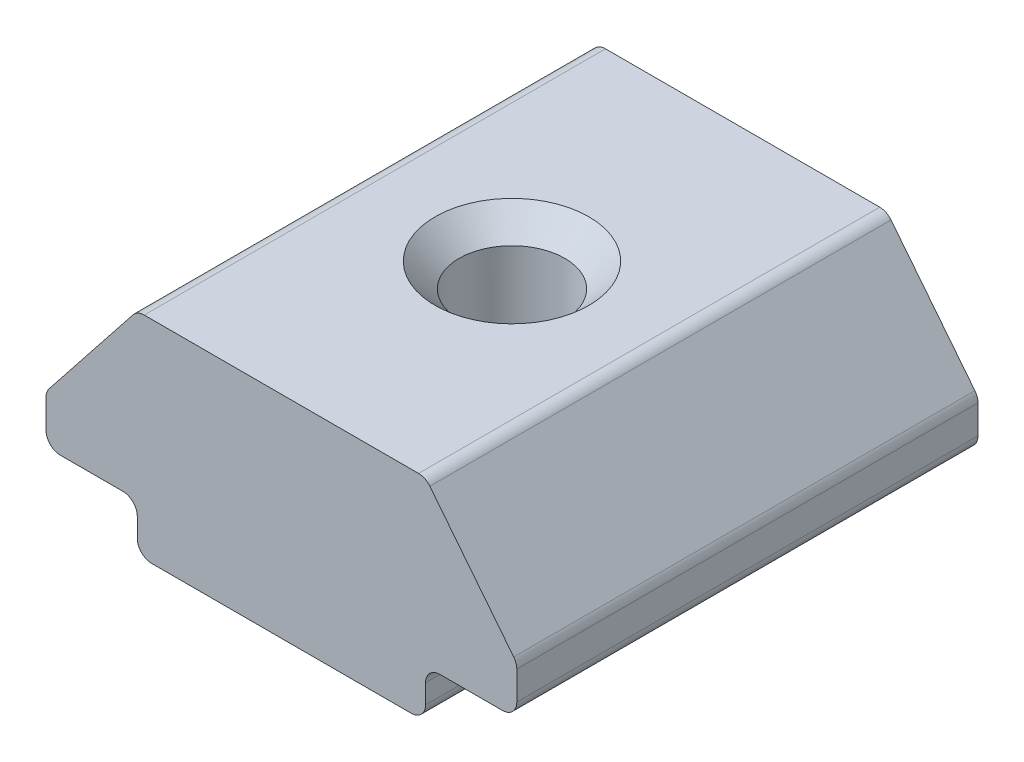
ISO-10303-21;
HEADER;
FILE_DESCRIPTION(('STEP AP214'),'2;1');
FILE_NAME('part.step','',(''),(''),'','','');
FILE_SCHEMA(('AUTOMOTIVE_DESIGN { 1 0 10303 214 1 1 1 1 }'));
ENDSEC;
DATA;
#1=APPLICATION_CONTEXT('core data for automotive mechanical design processes');
#2=APPLICATION_PROTOCOL_DEFINITION('international standard','automotive_design',2000,#1);
#3=PRODUCT_CONTEXT('',#1,'mechanical');
#4=PRODUCT('Part','Part','',(#3));
#5=PRODUCT_RELATED_PRODUCT_CATEGORY('part','',(#4));
#6=PRODUCT_DEFINITION_FORMATION('','',#4);
#7=PRODUCT_DEFINITION_CONTEXT('part definition',#1,'design');
#8=PRODUCT_DEFINITION('design','',#6,#7);
#9=PRODUCT_DEFINITION_SHAPE('','',#8);
#10=(LENGTH_UNIT() NAMED_UNIT(*) SI_UNIT(.MILLI.,.METRE.));
#11=(NAMED_UNIT(*) PLANE_ANGLE_UNIT() SI_UNIT($,.RADIAN.));
#12=(NAMED_UNIT(*) SI_UNIT($,.STERADIAN.) SOLID_ANGLE_UNIT());
#13=UNCERTAINTY_MEASURE_WITH_UNIT(LENGTH_MEASURE(1.E-05),#10,'distance_accuracy_value','');
#14=(GEOMETRIC_REPRESENTATION_CONTEXT(3) GLOBAL_UNCERTAINTY_ASSIGNED_CONTEXT((#13)) GLOBAL_UNIT_ASSIGNED_CONTEXT((#10,
#11,#12)) REPRESENTATION_CONTEXT('',''));
#15=CARTESIAN_POINT('',(0.,0.,0.));
#16=DIRECTION('',(0.,0.,1.));
#17=DIRECTION('',(1.,0.,0.));
#18=AXIS2_PLACEMENT_3D('',#15,#16,#17);
#19=CARTESIAN_POINT('',(-4.04930424271288,1.07470932668439,3.57496458987025));
#20=DIRECTION('',(1.,0.,0.));
#21=DIRECTION('',(0.,0.,-1.));
#22=AXIS2_PLACEMENT_3D('',#19,#20,#21);
#23=PLANE('',#22);
#24=DIRECTION('',(0.,-1.,0.));
#25=VECTOR('',#24,1.);
#26=CARTESIAN_POINT('',(-4.04930424271288,1.07470932668439,-6.02503541012975));
#27=LINE('',#26,#25);
#28=CARTESIAN_POINT('',(-4.04930424271288,0.774709326684388,-6.02503541012975));
#29=VERTEX_POINT('',#28);
#30=CARTESIAN_POINT('',(-4.04930424271288,0.374709326684388,-6.02503541012975));
#31=VERTEX_POINT('',#30);
#32=EDGE_CURVE('E314',#29,#31,#27,.T.);
#33=ORIENTED_EDGE('',*,*,#32,.T.);
#34=DIRECTION('',(0.,0.,-1.));
#35=VECTOR('',#34,1.);
#36=CARTESIAN_POINT('',(-4.04930424271288,0.374709326684388,3.57496458987025));
#37=LINE('',#36,#35);
#38=CARTESIAN_POINT('',(-4.04930424271288,0.374709326684388,3.57496458987025));
#39=VERTEX_POINT('',#38);
#40=EDGE_CURVE('E39',#31,#39,#37,.F.);
#41=ORIENTED_EDGE('',*,*,#40,.T.);
#42=DIRECTION('',(0.,-1.,0.));
#43=VECTOR('',#42,1.);
#44=CARTESIAN_POINT('',(-4.04930424271288,1.07470932668439,3.57496458987025));
#45=LINE('',#44,#43);
#46=CARTESIAN_POINT('',(-4.04930424271288,0.774709326684388,3.57496458987025));
#47=VERTEX_POINT('',#46);
#48=EDGE_CURVE('E183',#47,#39,#45,.T.);
#49=ORIENTED_EDGE('',*,*,#48,.F.);
#50=DIRECTION('',(0.,0.,-1.));
#51=VECTOR('',#50,1.);
#52=CARTESIAN_POINT('',(-4.04930424271288,0.774709326684388,-6.02503541012975));
#53=LINE('',#52,#51);
#54=EDGE_CURVE('E257',#47,#29,#53,.T.);
#55=ORIENTED_EDGE('',*,*,#54,.T.);
#56=EDGE_LOOP('',(#33,#41,#49,#55));
#57=FACE_BOUND('',#56,.T.);
#58=ADVANCED_FACE('F16',(#57),#23,.F.);
#59=CARTESIAN_POINT('',(-4.04930424271288,0.0747093266843879,3.57496458987025));
#60=DIRECTION('',(0.,1.,0.));
#61=DIRECTION('',(0.,0.,1.));
#62=AXIS2_PLACEMENT_3D('',#59,#60,#61);
#63=PLANE('',#62);
#64=CARTESIAN_POINT('',(-1.04930424271288,0.0747093266843879,-1.22503541012975));
#65=DIRECTION('',(0.,1.,0.));
#66=DIRECTION('',(0.,0.,1.));
#67=AXIS2_PLACEMENT_3D('',#64,#65,#66);
#68=CIRCLE('',#67,1.6);
#69=CARTESIAN_POINT('',(-1.04930424271288,0.0747093266843879,0.374964589870252));
#70=VERTEX_POINT('',#69);
#71=EDGE_CURVE('E10',#70,#70,#68,.T.);
#72=ORIENTED_EDGE('',*,*,#71,.T.);
#73=EDGE_LOOP('',(#72));
#74=FACE_BOUND('',#73,.T.);
#75=DIRECTION('',(1.,0.,0.));
#76=VECTOR('',#75,1.);
#77=CARTESIAN_POINT('',(-4.04930424271288,0.0747093266843879,-6.02503541012975));
#78=LINE('',#77,#76);
#79=CARTESIAN_POINT('',(-3.74930424271288,0.0747093266843879,-6.02503541012975));
#80=VERTEX_POINT('',#79);
#81=CARTESIAN_POINT('',(1.65069575728712,0.0747093266843879,-6.02503541012975));
#82=VERTEX_POINT('',#81);
#83=EDGE_CURVE('E308',#80,#82,#78,.T.);
#84=ORIENTED_EDGE('',*,*,#83,.T.);
#85=DIRECTION('',(0.,0.,-1.));
#86=VECTOR('',#85,1.);
#87=CARTESIAN_POINT('',(1.65069575728712,0.0747093266843879,3.57496458987025));
#88=LINE('',#87,#86);
#89=CARTESIAN_POINT('',(1.65069575728712,0.0747093266843879,3.57496458987025));
#90=VERTEX_POINT('',#89);
#91=EDGE_CURVE('E251',#82,#90,#88,.F.);
#92=ORIENTED_EDGE('',*,*,#91,.T.);
#93=DIRECTION('',(1.,0.,0.));
#94=VECTOR('',#93,1.);
#95=CARTESIAN_POINT('',(-4.04930424271288,0.0747093266843879,3.57496458987025));
#96=LINE('',#95,#94);
#97=CARTESIAN_POINT('',(-3.74930424271288,0.0747093266843879,3.57496458987025));
#98=VERTEX_POINT('',#97);
#99=EDGE_CURVE('E186',#98,#90,#96,.T.);
#100=ORIENTED_EDGE('',*,*,#99,.F.);
#101=DIRECTION('',(0.,0.,-1.));
#102=VECTOR('',#101,1.);
#103=CARTESIAN_POINT('',(-3.74930424271288,0.0747093266843879,3.57496458987025));
#104=LINE('',#103,#102);
#105=EDGE_CURVE('E248',#98,#80,#104,.T.);
#106=ORIENTED_EDGE('',*,*,#105,.T.);
#107=EDGE_LOOP('',(#84,#92,#100,#106));
#108=FACE_BOUND('',#107,.T.);
#109=ADVANCED_FACE('F301',(#74,#108),#63,.F.);
#110=CARTESIAN_POINT('',(1.95069575728712,0.0747093266843879,3.57496458987025));
#111=DIRECTION('',(-1.,0.,0.));
#112=DIRECTION('',(0.,0.,1.));
#113=AXIS2_PLACEMENT_3D('',#110,#111,#112);
#114=PLANE('',#113);
#115=DIRECTION('',(0.,1.,0.));
#116=VECTOR('',#115,1.);
#117=CARTESIAN_POINT('',(1.95069575728712,0.0747093266843879,3.57496458987025));
#118=LINE('',#117,#116);
#119=CARTESIAN_POINT('',(1.95069575728712,0.374709326684388,3.57496458987025));
#120=VERTEX_POINT('',#119);
#121=CARTESIAN_POINT('',(1.95069575728712,0.774709326684388,3.57496458987025));
#122=VERTEX_POINT('',#121);
#123=EDGE_CURVE('E321',#120,#122,#118,.T.);
#124=ORIENTED_EDGE('',*,*,#123,.F.);
#125=DIRECTION('',(0.,0.,-1.));
#126=VECTOR('',#125,1.);
#127=CARTESIAN_POINT('',(1.95069575728712,0.374709326684388,3.57496458987025));
#128=LINE('',#127,#126);
#129=CARTESIAN_POINT('',(1.95069575728712,0.374709326684388,-6.02503541012975));
#130=VERTEX_POINT('',#129);
#131=EDGE_CURVE('E241',#120,#130,#128,.T.);
#132=ORIENTED_EDGE('',*,*,#131,.T.);
#133=DIRECTION('',(0.,1.,0.));
#134=VECTOR('',#133,1.);
#135=CARTESIAN_POINT('',(1.95069575728712,0.0747093266843879,-6.02503541012975));
#136=LINE('',#135,#134);
#137=CARTESIAN_POINT('',(1.95069575728712,0.774709326684388,-6.02503541012975));
#138=VERTEX_POINT('',#137);
#139=EDGE_CURVE('E313',#130,#138,#136,.T.);
#140=ORIENTED_EDGE('',*,*,#139,.T.);
#141=DIRECTION('',(0.,0.,-1.));
#142=VECTOR('',#141,1.);
#143=CARTESIAN_POINT('',(1.95069575728712,0.774709326684388,3.57496458987025));
#144=LINE('',#143,#142);
#145=EDGE_CURVE('E239',#138,#122,#144,.F.);
#146=ORIENTED_EDGE('',*,*,#145,.T.);
#147=EDGE_LOOP('',(#124,#132,#140,#146));
#148=FACE_BOUND('',#147,.T.);
#149=ADVANCED_FACE('F304',(#148),#114,.F.);
#150=CARTESIAN_POINT('',(1.95069575728712,1.07470932668439,3.57496458987025));
#151=DIRECTION('',(0.,1.,0.));
#152=DIRECTION('',(0.,0.,1.));
#153=AXIS2_PLACEMENT_3D('',#150,#151,#152);
#154=PLANE('',#153);
#155=DIRECTION('',(1.,0.,0.));
#156=VECTOR('',#155,1.);
#157=CARTESIAN_POINT('',(1.95069575728712,1.07470932668439,3.57496458987025));
#158=LINE('',#157,#156);
#159=CARTESIAN_POINT('',(2.25069575728712,1.07470932668439,3.57496458987025));
#160=VERTEX_POINT('',#159);
#161=CARTESIAN_POINT('',(3.55069575728712,1.07470932668439,3.57496458987025));
#162=VERTEX_POINT('',#161);
#163=EDGE_CURVE('E325',#160,#162,#158,.T.);
#164=ORIENTED_EDGE('',*,*,#163,.F.);
#165=DIRECTION('',(0.,0.,-1.));
#166=VECTOR('',#165,1.);
#167=CARTESIAN_POINT('',(2.25069575728712,1.07470932668439,-6.02503541012975));
#168=LINE('',#167,#166);
#169=CARTESIAN_POINT('',(2.25069575728712,1.07470932668439,-6.02503541012975));
#170=VERTEX_POINT('',#169);
#171=EDGE_CURVE('E261',#160,#170,#168,.T.);
#172=ORIENTED_EDGE('',*,*,#171,.T.);
#173=DIRECTION('',(1.,0.,0.));
#174=VECTOR('',#173,1.);
#175=CARTESIAN_POINT('',(1.95069575728712,1.07470932668439,-6.02503541012975));
#176=LINE('',#175,#174);
#177=CARTESIAN_POINT('',(3.55069575728712,1.07470932668439,-6.02503541012975));
#178=VERTEX_POINT('',#177);
#179=EDGE_CURVE('E348',#170,#178,#176,.T.);
#180=ORIENTED_EDGE('',*,*,#179,.T.);
#181=DIRECTION('',(0.,0.,-1.));
#182=VECTOR('',#181,1.);
#183=CARTESIAN_POINT('',(3.55069575728712,1.07470932668439,3.57496458987025));
#184=LINE('',#183,#182);
#185=EDGE_CURVE('E236',#178,#162,#184,.F.);
#186=ORIENTED_EDGE('',*,*,#185,.T.);
#187=EDGE_LOOP('',(#164,#172,#180,#186));
#188=FACE_BOUND('',#187,.T.);
#189=ADVANCED_FACE('F549',(#188),#154,.F.);
#190=CARTESIAN_POINT('',(3.85069575728712,1.07470932668439,3.57496458987025));
#191=DIRECTION('',(-1.,0.,0.));
#192=DIRECTION('',(0.,0.,1.));
#193=AXIS2_PLACEMENT_3D('',#190,#191,#192);
#194=PLANE('',#193);
#195=DIRECTION('',(0.,1.,0.));
#196=VECTOR('',#195,1.);
#197=CARTESIAN_POINT('',(3.85069575728712,1.07470932668439,-6.02503541012975));
#198=LINE('',#197,#196);
#199=CARTESIAN_POINT('',(3.85069575728712,1.37470932668439,-6.02503541012975));
#200=VERTEX_POINT('',#199);
#201=CARTESIAN_POINT('',(3.85069575728712,1.97033370989447,-6.02503541012975));
#202=VERTEX_POINT('',#201);
#203=EDGE_CURVE('E350',#200,#202,#198,.T.);
#204=ORIENTED_EDGE('',*,*,#203,.T.);
#205=DIRECTION('',(0.,0.,-1.));
#206=VECTOR('',#205,1.);
#207=CARTESIAN_POINT('',(3.85069575728712,1.97033370989447,3.57496458987025));
#208=LINE('',#207,#206);
#209=CARTESIAN_POINT('',(3.85069575728712,1.97033370989447,3.57496458987025));
#210=VERTEX_POINT('',#209);
#211=EDGE_CURVE('E234',#202,#210,#208,.F.);
#212=ORIENTED_EDGE('',*,*,#211,.T.);
#213=DIRECTION('',(0.,1.,0.));
#214=VECTOR('',#213,1.);
#215=CARTESIAN_POINT('',(3.85069575728712,1.07470932668439,3.57496458987025));
#216=LINE('',#215,#214);
#217=CARTESIAN_POINT('',(3.85069575728712,1.37470932668439,3.57496458987025));
#218=VERTEX_POINT('',#217);
#219=EDGE_CURVE('E327',#218,#210,#216,.T.);
#220=ORIENTED_EDGE('',*,*,#219,.F.);
#221=DIRECTION('',(0.,0.,-1.));
#222=VECTOR('',#221,1.);
#223=CARTESIAN_POINT('',(3.85069575728712,1.37470932668439,3.57496458987025));
#224=LINE('',#223,#222);
#225=EDGE_CURVE('E231',#218,#200,#224,.T.);
#226=ORIENTED_EDGE('',*,*,#225,.T.);
#227=EDGE_LOOP('',(#204,#212,#220,#226));
#228=FACE_BOUND('',#227,.T.);
#229=ADVANCED_FACE('F540',(#228),#194,.F.);
#230=CARTESIAN_POINT('',(3.85069575728712,2.07470932668439,3.57496458987025));
#231=DIRECTION('',(-0.784045824461761,-0.620702944365561,0.));
#232=DIRECTION('',(0.620702944365561,-0.784045824461761,0.));
#233=AXIS2_PLACEMENT_3D('',#230,#231,#232);
#234=PLANE('',#233);
#235=DIRECTION('',(-0.620702944365561,0.784045824461761,0.));
#236=VECTOR('',#235,1.);
#237=CARTESIAN_POINT('',(3.85069575728712,2.07470932668439,-6.02503541012975));
#238=LINE('',#237,#236);
#239=CARTESIAN_POINT('',(3.78590950462565,2.15654459320414,-6.02503541012975));
#240=VERTEX_POINT('',#239);
#241=CARTESIAN_POINT('',(2.0407788080003,4.36092020999406,-6.02503541012975));
#242=VERTEX_POINT('',#241);
#243=EDGE_CURVE('E353',#240,#242,#238,.T.);
#244=ORIENTED_EDGE('',*,*,#243,.T.);
#245=DIRECTION('',(0.,0.,-1.));
#246=VECTOR('',#245,1.);
#247=CARTESIAN_POINT('',(2.0407788080003,4.36092020999406,3.57496458987025));
#248=LINE('',#247,#246);
#249=CARTESIAN_POINT('',(2.0407788080003,4.36092020999406,3.57496458987025));
#250=VERTEX_POINT('',#249);
#251=EDGE_CURVE('E229',#242,#250,#248,.F.);
#252=ORIENTED_EDGE('',*,*,#251,.T.);
#253=DIRECTION('',(-0.620702944365561,0.784045824461761,0.));
#254=VECTOR('',#253,1.);
#255=CARTESIAN_POINT('',(3.85069575728712,2.07470932668439,3.57496458987025));
#256=LINE('',#255,#254);
#257=CARTESIAN_POINT('',(3.78590950462565,2.15654459320414,3.57496458987025));
#258=VERTEX_POINT('',#257);
#259=EDGE_CURVE('E333',#258,#250,#256,.T.);
#260=ORIENTED_EDGE('',*,*,#259,.F.);
#261=DIRECTION('',(0.,0.,-1.));
#262=VECTOR('',#261,1.);
#263=CARTESIAN_POINT('',(3.78590950462565,2.15654459320414,3.57496458987025));
#264=LINE('',#263,#262);
#265=EDGE_CURVE('E226',#258,#240,#264,.T.);
#266=ORIENTED_EDGE('',*,*,#265,.T.);
#267=EDGE_LOOP('',(#244,#252,#260,#266));
#268=FACE_BOUND('',#267,.T.);
#269=ADVANCED_FACE('F532',(#268),#234,.F.);
#270=CARTESIAN_POINT('',(1.95069575728712,4.47470932668439,3.57496458987025));
#271=DIRECTION('',(0.,-1.,0.));
#272=DIRECTION('',(0.,0.,-1.));
#273=AXIS2_PLACEMENT_3D('',#270,#271,#272);
#274=PLANE('',#273);
#275=CARTESIAN_POINT('',(-1.04930424271288,4.47470932668439,-1.22503541012975));
#276=DIRECTION('',(0.,-1.,0.));
#277=DIRECTION('',(0.,0.,-1.));
#278=AXIS2_PLACEMENT_3D('',#275,#276,#277);
#279=CIRCLE('',#278,1.6);
#280=CARTESIAN_POINT('',(-1.04930424271288,4.47470932668439,-2.82503541012975));
#281=VERTEX_POINT('',#280);
#282=EDGE_CURVE('E24',#281,#281,#279,.T.);
#283=ORIENTED_EDGE('',*,*,#282,.T.);
#284=EDGE_LOOP('',(#283));
#285=FACE_BOUND('',#284,.T.);
#286=DIRECTION('',(-1.,0.,0.));
#287=VECTOR('',#286,1.);
#288=CARTESIAN_POINT('',(1.95069575728712,4.47470932668439,-6.02503541012975));
#289=LINE('',#288,#287);
#290=CARTESIAN_POINT('',(1.80556506066177,4.47470932668439,-6.02503541012975));
#291=VERTEX_POINT('',#290);
#292=CARTESIAN_POINT('',(-3.90417354608753,4.47470932668439,-6.02503541012975));
#293=VERTEX_POINT('',#292);
#294=EDGE_CURVE('E356',#291,#293,#289,.T.);
#295=ORIENTED_EDGE('',*,*,#294,.T.);
#296=DIRECTION('',(0.,0.,-1.));
#297=VECTOR('',#296,1.);
#298=CARTESIAN_POINT('',(-3.90417354608753,4.47470932668439,3.57496458987025));
#299=LINE('',#298,#297);
#300=CARTESIAN_POINT('',(-3.90417354608753,4.47470932668439,3.57496458987025));
#301=VERTEX_POINT('',#300);
#302=EDGE_CURVE('E224',#293,#301,#299,.F.);
#303=ORIENTED_EDGE('',*,*,#302,.T.);
#304=DIRECTION('',(-1.,0.,0.));
#305=VECTOR('',#304,1.);
#306=CARTESIAN_POINT('',(1.95069575728712,4.47470932668439,3.57496458987025));
#307=LINE('',#306,#305);
#308=CARTESIAN_POINT('',(1.80556506066177,4.47470932668439,3.57496458987025));
#309=VERTEX_POINT('',#308);
#310=EDGE_CURVE('E336',#309,#301,#307,.T.);
#311=ORIENTED_EDGE('',*,*,#310,.F.);
#312=DIRECTION('',(0.,0.,-1.));
#313=VECTOR('',#312,1.);
#314=CARTESIAN_POINT('',(1.80556506066177,4.47470932668439,3.57496458987025));
#315=LINE('',#314,#313);
#316=EDGE_CURVE('E221',#309,#291,#315,.T.);
#317=ORIENTED_EDGE('',*,*,#316,.T.);
#318=EDGE_LOOP('',(#295,#303,#311,#317));
#319=FACE_BOUND('',#318,.T.);
#320=ADVANCED_FACE('F280',(#285,#319),#274,.F.);
#321=CARTESIAN_POINT('',(-5.94930424271288,2.07470932668439,3.57496458987025));
#322=DIRECTION('',(0.784045824461761,-0.620702944365561,0.));
#323=DIRECTION('',(0.620702944365561,0.784045824461761,0.));
#324=AXIS2_PLACEMENT_3D('',#321,#322,#323);
#325=PLANE('',#324);
#326=DIRECTION('',(-0.620702944365561,-0.784045824461761,0.));
#327=VECTOR('',#326,1.);
#328=CARTESIAN_POINT('',(-5.94930424271288,2.07470932668439,-6.02503541012975));
#329=LINE('',#328,#327);
#330=CARTESIAN_POINT('',(-4.13938729342606,4.36092020999406,-6.02503541012975));
#331=VERTEX_POINT('',#330);
#332=CARTESIAN_POINT('',(-5.88451799005141,2.15654459320414,-6.02503541012975));
#333=VERTEX_POINT('',#332);
#334=EDGE_CURVE('E188',#331,#333,#329,.T.);
#335=ORIENTED_EDGE('',*,*,#334,.T.);
#336=DIRECTION('',(0.,0.,-1.));
#337=VECTOR('',#336,1.);
#338=CARTESIAN_POINT('',(-5.88451799005141,2.15654459320414,3.57496458987025));
#339=LINE('',#338,#337);
#340=CARTESIAN_POINT('',(-5.88451799005141,2.15654459320414,3.57496458987025));
#341=VERTEX_POINT('',#340);
#342=EDGE_CURVE('E219',#333,#341,#339,.F.);
#343=ORIENTED_EDGE('',*,*,#342,.T.);
#344=DIRECTION('',(-0.620702944365561,-0.784045824461761,0.));
#345=VECTOR('',#344,1.);
#346=CARTESIAN_POINT('',(-5.94930424271288,2.07470932668439,3.57496458987025));
#347=LINE('',#346,#345);
#348=CARTESIAN_POINT('',(-4.13938729342606,4.36092020999406,3.57496458987025));
#349=VERTEX_POINT('',#348);
#350=EDGE_CURVE('E339',#349,#341,#347,.T.);
#351=ORIENTED_EDGE('',*,*,#350,.F.);
#352=DIRECTION('',(0.,0.,-1.));
#353=VECTOR('',#352,1.);
#354=CARTESIAN_POINT('',(-4.13938729342606,4.36092020999406,3.57496458987025));
#355=LINE('',#354,#353);
#356=EDGE_CURVE('E216',#349,#331,#355,.T.);
#357=ORIENTED_EDGE('',*,*,#356,.T.);
#358=EDGE_LOOP('',(#335,#343,#351,#357));
#359=FACE_BOUND('',#358,.T.);
#360=ADVANCED_FACE('F362',(#359),#325,.F.);
#361=CARTESIAN_POINT('',(-5.94930424271288,1.07470932668439,3.57496458987025));
#362=DIRECTION('',(1.,0.,0.));
#363=DIRECTION('',(0.,0.,-1.));
#364=AXIS2_PLACEMENT_3D('',#361,#362,#363);
#365=PLANE('',#364);
#366=DIRECTION('',(0.,-1.,0.));
#367=VECTOR('',#366,1.);
#368=CARTESIAN_POINT('',(-5.94930424271288,1.07470932668439,-6.02503541012975));
#369=LINE('',#368,#367);
#370=CARTESIAN_POINT('',(-5.94930424271288,1.97033370989447,-6.02503541012975));
#371=VERTEX_POINT('',#370);
#372=CARTESIAN_POINT('',(-5.94930424271288,1.37470932668439,-6.02503541012975));
#373=VERTEX_POINT('',#372);
#374=EDGE_CURVE('E184',#371,#373,#369,.T.);
#375=ORIENTED_EDGE('',*,*,#374,.T.);
#376=DIRECTION('',(0.,0.,-1.));
#377=VECTOR('',#376,1.);
#378=CARTESIAN_POINT('',(-5.94930424271288,1.37470932668439,3.57496458987025));
#379=LINE('',#378,#377);
#380=CARTESIAN_POINT('',(-5.94930424271288,1.37470932668439,3.57496458987025));
#381=VERTEX_POINT('',#380);
#382=EDGE_CURVE('E161',#373,#381,#379,.F.);
#383=ORIENTED_EDGE('',*,*,#382,.T.);
#384=DIRECTION('',(0.,-1.,0.));
#385=VECTOR('',#384,1.);
#386=CARTESIAN_POINT('',(-5.94930424271288,1.07470932668439,3.57496458987025));
#387=LINE('',#386,#385);
#388=CARTESIAN_POINT('',(-5.94930424271288,1.97033370989447,3.57496458987025));
#389=VERTEX_POINT('',#388);
#390=EDGE_CURVE('E342',#389,#381,#387,.T.);
#391=ORIENTED_EDGE('',*,*,#390,.F.);
#392=DIRECTION('',(0.,0.,-1.));
#393=VECTOR('',#392,1.);
#394=CARTESIAN_POINT('',(-5.94930424271288,1.97033370989447,3.57496458987025));
#395=LINE('',#394,#393);
#396=EDGE_CURVE('E166',#389,#371,#395,.T.);
#397=ORIENTED_EDGE('',*,*,#396,.T.);
#398=EDGE_LOOP('',(#375,#383,#391,#397));
#399=FACE_BOUND('',#398,.T.);
#400=ADVANCED_FACE('F371',(#399),#365,.F.);
#401=CARTESIAN_POINT('',(-5.94930424271288,1.07470932668439,3.57496458987025));
#402=DIRECTION('',(0.,1.,0.));
#403=DIRECTION('',(0.,0.,1.));
#404=AXIS2_PLACEMENT_3D('',#401,#402,#403);
#405=PLANE('',#404);
#406=DIRECTION('',(1.,0.,0.));
#407=VECTOR('',#406,1.);
#408=CARTESIAN_POINT('',(-5.94930424271288,1.07470932668439,-6.02503541012975));
#409=LINE('',#408,#407);
#410=CARTESIAN_POINT('',(-5.64930424271288,1.07470932668439,-6.02503541012975));
#411=VERTEX_POINT('',#410);
#412=CARTESIAN_POINT('',(-4.34930424271288,1.07470932668439,-6.02503541012975));
#413=VERTEX_POINT('',#412);
#414=EDGE_CURVE('E173',#411,#413,#409,.T.);
#415=ORIENTED_EDGE('',*,*,#414,.T.);
#416=DIRECTION('',(0.,0.,-1.));
#417=VECTOR('',#416,1.);
#418=CARTESIAN_POINT('',(-4.34930424271288,1.07470932668439,3.57496458987025));
#419=LINE('',#418,#417);
#420=CARTESIAN_POINT('',(-4.34930424271288,1.07470932668439,3.57496458987025));
#421=VERTEX_POINT('',#420);
#422=EDGE_CURVE('E264',#413,#421,#419,.F.);
#423=ORIENTED_EDGE('',*,*,#422,.T.);
#424=DIRECTION('',(1.,0.,0.));
#425=VECTOR('',#424,1.);
#426=CARTESIAN_POINT('',(-5.94930424271288,1.07470932668439,3.57496458987025));
#427=LINE('',#426,#425);
#428=CARTESIAN_POINT('',(-5.64930424271288,1.07470932668439,3.57496458987025));
#429=VERTEX_POINT('',#428);
#430=EDGE_CURVE('E176',#429,#421,#427,.T.);
#431=ORIENTED_EDGE('',*,*,#430,.F.);
#432=DIRECTION('',(0.,0.,-1.));
#433=VECTOR('',#432,1.);
#434=CARTESIAN_POINT('',(-5.64930424271288,1.07470932668439,3.57496458987025));
#435=LINE('',#434,#433);
#436=EDGE_CURVE('E160',#429,#411,#435,.T.);
#437=ORIENTED_EDGE('',*,*,#436,.T.);
#438=EDGE_LOOP('',(#415,#423,#431,#437));
#439=FACE_BOUND('',#438,.T.);
#440=ADVANCED_FACE('F172',(#439),#405,.F.);
#441=CARTESIAN_POINT('',(-1.04930424271288,0.0747093266843879,3.57496458987025));
#442=DIRECTION('',(0.,0.,1.));
#443=DIRECTION('',(1.,0.,0.));
#444=AXIS2_PLACEMENT_3D('',#441,#442,#443);
#445=PLANE('',#444);
#446=ORIENTED_EDGE('',*,*,#99,.T.);
#447=CARTESIAN_POINT('',(1.65069575728712,0.374709326684388,3.57496458987025));
#448=DIRECTION('',(0.,0.,1.));
#449=DIRECTION('',(1.,0.,0.));
#450=AXIS2_PLACEMENT_3D('',#447,#448,#449);
#451=CIRCLE('',#450,0.3);
#452=EDGE_CURVE('E255',#90,#120,#451,.T.);
#453=ORIENTED_EDGE('',*,*,#452,.T.);
#454=ORIENTED_EDGE('',*,*,#123,.T.);
#455=CARTESIAN_POINT('',(2.25069575728712,0.774709326684388,3.57496458987025));
#456=DIRECTION('',(0.,0.,1.));
#457=DIRECTION('',(1.,0.,0.));
#458=AXIS2_PLACEMENT_3D('',#455,#456,#457);
#459=CIRCLE('',#458,0.3);
#460=EDGE_CURVE('E31',#122,#160,#459,.F.);
#461=ORIENTED_EDGE('',*,*,#460,.T.);
#462=ORIENTED_EDGE('',*,*,#163,.T.);
#463=CARTESIAN_POINT('',(3.55069575728712,1.37470932668439,3.57496458987025));
#464=DIRECTION('',(0.,0.,1.));
#465=DIRECTION('',(1.,0.,0.));
#466=AXIS2_PLACEMENT_3D('',#463,#464,#465);
#467=CIRCLE('',#466,0.3);
#468=EDGE_CURVE('E204',#162,#218,#467,.T.);
#469=ORIENTED_EDGE('',*,*,#468,.T.);
#470=ORIENTED_EDGE('',*,*,#219,.T.);
#471=CARTESIAN_POINT('',(3.55069575728712,1.97033370989447,3.57496458987025));
#472=DIRECTION('',(0.,0.,1.));
#473=DIRECTION('',(1.,0.,0.));
#474=AXIS2_PLACEMENT_3D('',#471,#472,#473);
#475=CIRCLE('',#474,0.3);
#476=EDGE_CURVE('E206',#210,#258,#475,.T.);
#477=ORIENTED_EDGE('',*,*,#476,.T.);
#478=ORIENTED_EDGE('',*,*,#259,.T.);
#479=CARTESIAN_POINT('',(1.80556506066177,4.17470932668439,3.57496458987025));
#480=DIRECTION('',(0.,0.,1.));
#481=DIRECTION('',(1.,0.,0.));
#482=AXIS2_PLACEMENT_3D('',#479,#480,#481);
#483=CIRCLE('',#482,0.3);
#484=EDGE_CURVE('E208',#250,#309,#483,.T.);
#485=ORIENTED_EDGE('',*,*,#484,.T.);
#486=ORIENTED_EDGE('',*,*,#310,.T.);
#487=CARTESIAN_POINT('',(-3.90417354608753,4.17470932668439,3.57496458987025));
#488=DIRECTION('',(0.,0.,1.));
#489=DIRECTION('',(1.,0.,0.));
#490=AXIS2_PLACEMENT_3D('',#487,#488,#489);
#491=CIRCLE('',#490,0.3);
#492=EDGE_CURVE('E210',#301,#349,#491,.T.);
#493=ORIENTED_EDGE('',*,*,#492,.T.);
#494=ORIENTED_EDGE('',*,*,#350,.T.);
#495=CARTESIAN_POINT('',(-5.64930424271288,1.97033370989447,3.57496458987025));
#496=DIRECTION('',(0.,0.,1.));
#497=DIRECTION('',(1.,0.,0.));
#498=AXIS2_PLACEMENT_3D('',#495,#496,#497);
#499=CIRCLE('',#498,0.3);
#500=EDGE_CURVE('E212',#341,#389,#499,.T.);
#501=ORIENTED_EDGE('',*,*,#500,.T.);
#502=ORIENTED_EDGE('',*,*,#390,.T.);
#503=CARTESIAN_POINT('',(-5.64930424271288,1.37470932668439,3.57496458987025));
#504=DIRECTION('',(0.,0.,1.));
#505=DIRECTION('',(1.,0.,0.));
#506=AXIS2_PLACEMENT_3D('',#503,#504,#505);
#507=CIRCLE('',#506,0.3);
#508=EDGE_CURVE('E214',#381,#429,#507,.T.);
#509=ORIENTED_EDGE('',*,*,#508,.T.);
#510=ORIENTED_EDGE('',*,*,#430,.T.);
#511=CARTESIAN_POINT('',(-4.34930424271288,0.774709326684388,3.57496458987025));
#512=DIRECTION('',(0.,0.,1.));
#513=DIRECTION('',(1.,0.,0.));
#514=AXIS2_PLACEMENT_3D('',#511,#512,#513);
#515=CIRCLE('',#514,0.3);
#516=EDGE_CURVE('E270',#421,#47,#515,.F.);
#517=ORIENTED_EDGE('',*,*,#516,.T.);
#518=ORIENTED_EDGE('',*,*,#48,.T.);
#519=CARTESIAN_POINT('',(-3.74930424271288,0.374709326684388,3.57496458987025));
#520=DIRECTION('',(0.,0.,1.));
#521=DIRECTION('',(1.,0.,0.));
#522=AXIS2_PLACEMENT_3D('',#519,#520,#521);
#523=CIRCLE('',#522,0.3);
#524=EDGE_CURVE('E253',#39,#98,#523,.T.);
#525=ORIENTED_EDGE('',*,*,#524,.T.);
#526=EDGE_LOOP('',(#446,#453,#454,#461,#462,#469,#470,#477,#478,#485,#486,#493,#494,#501,#502,
#509,#510,#517,#518,#525));
#527=FACE_BOUND('',#526,.T.);
#528=ADVANCED_FACE('F320',(#527),#445,.T.);
#529=CARTESIAN_POINT('',(-1.04930424271288,0.0747093266843879,-6.02503541012975));
#530=DIRECTION('',(0.,0.,1.));
#531=DIRECTION('',(1.,0.,0.));
#532=AXIS2_PLACEMENT_3D('',#529,#530,#531);
#533=PLANE('',#532);
#534=ORIENTED_EDGE('',*,*,#139,.F.);
#535=CARTESIAN_POINT('',(1.65069575728712,0.374709326684388,-6.02503541012975));
#536=DIRECTION('',(0.,0.,1.));
#537=DIRECTION('',(1.,0.,0.));
#538=AXIS2_PLACEMENT_3D('',#535,#536,#537);
#539=CIRCLE('',#538,0.3);
#540=EDGE_CURVE('E246',#130,#82,#539,.F.);
#541=ORIENTED_EDGE('',*,*,#540,.T.);
#542=ORIENTED_EDGE('',*,*,#83,.F.);
#543=CARTESIAN_POINT('',(-3.74930424271288,0.374709326684388,-6.02503541012975));
#544=DIRECTION('',(0.,0.,1.));
#545=DIRECTION('',(1.,0.,0.));
#546=AXIS2_PLACEMENT_3D('',#543,#544,#545);
#547=CIRCLE('',#546,0.3);
#548=EDGE_CURVE('E244',#80,#31,#547,.F.);
#549=ORIENTED_EDGE('',*,*,#548,.T.);
#550=ORIENTED_EDGE('',*,*,#32,.F.);
#551=CARTESIAN_POINT('',(-4.34930424271288,0.774709326684388,-6.02503541012975));
#552=DIRECTION('',(0.,0.,1.));
#553=DIRECTION('',(1.,0.,0.));
#554=AXIS2_PLACEMENT_3D('',#551,#552,#553);
#555=CIRCLE('',#554,0.3);
#556=EDGE_CURVE('E182',#29,#413,#555,.T.);
#557=ORIENTED_EDGE('',*,*,#556,.T.);
#558=ORIENTED_EDGE('',*,*,#414,.F.);
#559=CARTESIAN_POINT('',(-5.64930424271288,1.37470932668439,-6.02503541012975));
#560=DIRECTION('',(0.,0.,1.));
#561=DIRECTION('',(1.,0.,0.));
#562=AXIS2_PLACEMENT_3D('',#559,#560,#561);
#563=CIRCLE('',#562,0.3);
#564=EDGE_CURVE('E156',#411,#373,#563,.F.);
#565=ORIENTED_EDGE('',*,*,#564,.T.);
#566=ORIENTED_EDGE('',*,*,#374,.F.);
#567=CARTESIAN_POINT('',(-5.64930424271288,1.97033370989447,-6.02503541012975));
#568=DIRECTION('',(0.,0.,1.));
#569=DIRECTION('',(1.,0.,0.));
#570=AXIS2_PLACEMENT_3D('',#567,#568,#569);
#571=CIRCLE('',#570,0.3);
#572=EDGE_CURVE('E167',#371,#333,#571,.F.);
#573=ORIENTED_EDGE('',*,*,#572,.T.);
#574=ORIENTED_EDGE('',*,*,#334,.F.);
#575=CARTESIAN_POINT('',(-3.90417354608753,4.17470932668439,-6.02503541012975));
#576=DIRECTION('',(0.,0.,1.));
#577=DIRECTION('',(1.,0.,0.));
#578=AXIS2_PLACEMENT_3D('',#575,#576,#577);
#579=CIRCLE('',#578,0.3);
#580=EDGE_CURVE('E198',#331,#293,#579,.F.);
#581=ORIENTED_EDGE('',*,*,#580,.T.);
#582=ORIENTED_EDGE('',*,*,#294,.F.);
#583=CARTESIAN_POINT('',(1.80556506066177,4.17470932668439,-6.02503541012975));
#584=DIRECTION('',(0.,0.,1.));
#585=DIRECTION('',(1.,0.,0.));
#586=AXIS2_PLACEMENT_3D('',#583,#584,#585);
#587=CIRCLE('',#586,0.3);
#588=EDGE_CURVE('E196',#291,#242,#587,.F.);
#589=ORIENTED_EDGE('',*,*,#588,.T.);
#590=ORIENTED_EDGE('',*,*,#243,.F.);
#591=CARTESIAN_POINT('',(3.55069575728712,1.97033370989447,-6.02503541012975));
#592=DIRECTION('',(0.,0.,1.));
#593=DIRECTION('',(1.,0.,0.));
#594=AXIS2_PLACEMENT_3D('',#591,#592,#593);
#595=CIRCLE('',#594,0.3);
#596=EDGE_CURVE('E194',#240,#202,#595,.F.);
#597=ORIENTED_EDGE('',*,*,#596,.T.);
#598=ORIENTED_EDGE('',*,*,#203,.F.);
#599=CARTESIAN_POINT('',(3.55069575728712,1.37470932668439,-6.02503541012975));
#600=DIRECTION('',(0.,0.,1.));
#601=DIRECTION('',(1.,0.,0.));
#602=AXIS2_PLACEMENT_3D('',#599,#600,#601);
#603=CIRCLE('',#602,0.3);
#604=EDGE_CURVE('E177',#200,#178,#603,.F.);
#605=ORIENTED_EDGE('',*,*,#604,.T.);
#606=ORIENTED_EDGE('',*,*,#179,.F.);
#607=CARTESIAN_POINT('',(2.25069575728712,0.774709326684388,-6.02503541012975));
#608=DIRECTION('',(0.,0.,1.));
#609=DIRECTION('',(1.,0.,0.));
#610=AXIS2_PLACEMENT_3D('',#607,#608,#609);
#611=CIRCLE('',#610,0.3);
#612=EDGE_CURVE('E266',#170,#138,#611,.T.);
#613=ORIENTED_EDGE('',*,*,#612,.T.);
#614=EDGE_LOOP('',(#534,#541,#542,#549,#550,#557,#558,#565,#566,#573,#574,#581,#582,#589,#590,
#597,#598,#605,#606,#613));
#615=FACE_BOUND('',#614,.T.);
#616=ADVANCED_FACE('F180',(#615),#533,.F.);
#617=CARTESIAN_POINT('',(-5.64930424271288,1.37470932668439,3.57496458987025));
#618=DIRECTION('',(0.,0.,-1.));
#619=DIRECTION('',(-1.,0.,0.));
#620=AXIS2_PLACEMENT_3D('',#617,#618,#619);
#621=CYLINDRICAL_SURFACE('',#620,0.3);
#622=ORIENTED_EDGE('',*,*,#508,.F.);
#623=ORIENTED_EDGE('',*,*,#382,.F.);
#624=ORIENTED_EDGE('',*,*,#564,.F.);
#625=ORIENTED_EDGE('',*,*,#436,.F.);
#626=EDGE_LOOP('',(#622,#623,#624,#625));
#627=FACE_BOUND('',#626,.T.);
#628=ADVANCED_FACE('F159',(#627),#621,.T.);
#629=CARTESIAN_POINT('',(-5.64930424271288,1.97033370989447,3.57496458987025));
#630=DIRECTION('',(0.,0.,-1.));
#631=DIRECTION('',(-1.,0.,0.));
#632=AXIS2_PLACEMENT_3D('',#629,#630,#631);
#633=CYLINDRICAL_SURFACE('',#632,0.3);
#634=ORIENTED_EDGE('',*,*,#500,.F.);
#635=ORIENTED_EDGE('',*,*,#342,.F.);
#636=ORIENTED_EDGE('',*,*,#572,.F.);
#637=ORIENTED_EDGE('',*,*,#396,.F.);
#638=EDGE_LOOP('',(#634,#635,#636,#637));
#639=FACE_BOUND('',#638,.T.);
#640=ADVANCED_FACE('F367',(#639),#633,.T.);
#641=CARTESIAN_POINT('',(-3.90417354608753,4.17470932668439,3.57496458987025));
#642=DIRECTION('',(0.,0.,-1.));
#643=DIRECTION('',(-1.,0.,0.));
#644=AXIS2_PLACEMENT_3D('',#641,#642,#643);
#645=CYLINDRICAL_SURFACE('',#644,0.3);
#646=ORIENTED_EDGE('',*,*,#492,.F.);
#647=ORIENTED_EDGE('',*,*,#302,.F.);
#648=ORIENTED_EDGE('',*,*,#580,.F.);
#649=ORIENTED_EDGE('',*,*,#356,.F.);
#650=EDGE_LOOP('',(#646,#647,#648,#649));
#651=FACE_BOUND('',#650,.T.);
#652=ADVANCED_FACE('F391',(#651),#645,.T.);
#653=CARTESIAN_POINT('',(1.80556506066177,4.17470932668439,3.57496458987025));
#654=DIRECTION('',(0.,0.,-1.));
#655=DIRECTION('',(-1.,0.,0.));
#656=AXIS2_PLACEMENT_3D('',#653,#654,#655);
#657=CYLINDRICAL_SURFACE('',#656,0.3);
#658=ORIENTED_EDGE('',*,*,#484,.F.);
#659=ORIENTED_EDGE('',*,*,#251,.F.);
#660=ORIENTED_EDGE('',*,*,#588,.F.);
#661=ORIENTED_EDGE('',*,*,#316,.F.);
#662=EDGE_LOOP('',(#658,#659,#660,#661));
#663=FACE_BOUND('',#662,.T.);
#664=ADVANCED_FACE('F394',(#663),#657,.T.);
#665=CARTESIAN_POINT('',(3.55069575728712,1.97033370989447,3.57496458987025));
#666=DIRECTION('',(0.,0.,-1.));
#667=DIRECTION('',(-1.,0.,0.));
#668=AXIS2_PLACEMENT_3D('',#665,#666,#667);
#669=CYLINDRICAL_SURFACE('',#668,0.3);
#670=ORIENTED_EDGE('',*,*,#476,.F.);
#671=ORIENTED_EDGE('',*,*,#211,.F.);
#672=ORIENTED_EDGE('',*,*,#596,.F.);
#673=ORIENTED_EDGE('',*,*,#265,.F.);
#674=EDGE_LOOP('',(#670,#671,#672,#673));
#675=FACE_BOUND('',#674,.T.);
#676=ADVANCED_FACE('F398',(#675),#669,.T.);
#677=CARTESIAN_POINT('',(3.55069575728712,1.37470932668439,3.57496458987025));
#678=DIRECTION('',(0.,0.,-1.));
#679=DIRECTION('',(-1.,0.,0.));
#680=AXIS2_PLACEMENT_3D('',#677,#678,#679);
#681=CYLINDRICAL_SURFACE('',#680,0.3);
#682=ORIENTED_EDGE('',*,*,#468,.F.);
#683=ORIENTED_EDGE('',*,*,#185,.F.);
#684=ORIENTED_EDGE('',*,*,#604,.F.);
#685=ORIENTED_EDGE('',*,*,#225,.F.);
#686=EDGE_LOOP('',(#682,#683,#684,#685));
#687=FACE_BOUND('',#686,.T.);
#688=ADVANCED_FACE('F293',(#687),#681,.T.);
#689=CARTESIAN_POINT('',(-1.04930424271288,0.0747093266843879,-1.22503541012975));
#690=DIRECTION('',(0.,1.,0.));
#691=DIRECTION('',(0.,0.,1.));
#692=AXIS2_PLACEMENT_3D('',#689,#690,#691);
#693=CYLINDRICAL_SURFACE('',#692,1.1);
#694=CARTESIAN_POINT('',(-1.04930424271288,3.97470932668439,-1.22503541012975));
#695=DIRECTION('',(0.,-1.,0.));
#696=DIRECTION('',(0.,0.,-1.));
#697=AXIS2_PLACEMENT_3D('',#694,#695,#696);
#698=CIRCLE('',#697,1.1);
#699=CARTESIAN_POINT('',(-1.04930424271288,3.97470932668439,-2.32503541012975));
#700=VERTEX_POINT('',#699);
#701=EDGE_CURVE('E275',#700,#700,#698,.F.);
#702=ORIENTED_EDGE('',*,*,#701,.T.);
#703=EDGE_LOOP('',(#702));
#704=FACE_BOUND('',#703,.T.);
#705=CARTESIAN_POINT('',(-1.04930424271288,0.574709326684388,-1.22503541012975));
#706=DIRECTION('',(0.,1.,0.));
#707=DIRECTION('',(0.,0.,1.));
#708=AXIS2_PLACEMENT_3D('',#705,#706,#707);
#709=CIRCLE('',#708,1.1);
#710=CARTESIAN_POINT('',(-1.04930424271288,0.574709326684388,-0.125035410129749));
#711=VERTEX_POINT('',#710);
#712=EDGE_CURVE('E272',#711,#711,#709,.F.);
#713=ORIENTED_EDGE('',*,*,#712,.T.);
#714=EDGE_LOOP('',(#713));
#715=FACE_BOUND('',#714,.T.);
#716=ADVANCED_FACE('F289',(#704,#715),#693,.F.);
#717=CARTESIAN_POINT('',(1.65069575728712,0.374709326684388,3.57496458987025));
#718=DIRECTION('',(0.,0.,-1.));
#719=DIRECTION('',(-1.,0.,0.));
#720=AXIS2_PLACEMENT_3D('',#717,#718,#719);
#721=CYLINDRICAL_SURFACE('',#720,0.3);
#722=ORIENTED_EDGE('',*,*,#452,.F.);
#723=ORIENTED_EDGE('',*,*,#91,.F.);
#724=ORIENTED_EDGE('',*,*,#540,.F.);
#725=ORIENTED_EDGE('',*,*,#131,.F.);
#726=EDGE_LOOP('',(#722,#723,#724,#725));
#727=FACE_BOUND('',#726,.T.);
#728=ADVANCED_FACE('F292',(#727),#721,.T.);
#729=CARTESIAN_POINT('',(-3.74930424271288,0.374709326684388,3.57496458987025));
#730=DIRECTION('',(0.,0.,-1.));
#731=DIRECTION('',(-1.,0.,0.));
#732=AXIS2_PLACEMENT_3D('',#729,#730,#731);
#733=CYLINDRICAL_SURFACE('',#732,0.3);
#734=ORIENTED_EDGE('',*,*,#524,.F.);
#735=ORIENTED_EDGE('',*,*,#40,.F.);
#736=ORIENTED_EDGE('',*,*,#548,.F.);
#737=ORIENTED_EDGE('',*,*,#105,.F.);
#738=EDGE_LOOP('',(#734,#735,#736,#737));
#739=FACE_BOUND('',#738,.T.);
#740=ADVANCED_FACE('F408',(#739),#733,.T.);
#741=CARTESIAN_POINT('',(2.25069575728712,0.774709326684388,3.57496458987025));
#742=DIRECTION('',(0.,0.,1.));
#743=DIRECTION('',(1.,0.,0.));
#744=AXIS2_PLACEMENT_3D('',#741,#742,#743);
#745=CYLINDRICAL_SURFACE('',#744,0.3);
#746=ORIENTED_EDGE('',*,*,#460,.F.);
#747=ORIENTED_EDGE('',*,*,#145,.F.);
#748=ORIENTED_EDGE('',*,*,#612,.F.);
#749=ORIENTED_EDGE('',*,*,#171,.F.);
#750=EDGE_LOOP('',(#746,#747,#748,#749));
#751=FACE_BOUND('',#750,.T.);
#752=ADVANCED_FACE('F411',(#751),#745,.F.);
#753=CARTESIAN_POINT('',(-4.34930424271288,0.774709326684388,3.57496458987025));
#754=DIRECTION('',(0.,0.,1.));
#755=DIRECTION('',(1.,0.,0.));
#756=AXIS2_PLACEMENT_3D('',#753,#754,#755);
#757=CYLINDRICAL_SURFACE('',#756,0.3);
#758=ORIENTED_EDGE('',*,*,#516,.F.);
#759=ORIENTED_EDGE('',*,*,#422,.F.);
#760=ORIENTED_EDGE('',*,*,#556,.F.);
#761=ORIENTED_EDGE('',*,*,#54,.F.);
#762=EDGE_LOOP('',(#758,#759,#760,#761));
#763=FACE_BOUND('',#762,.T.);
#764=ADVANCED_FACE('F286',(#763),#757,.F.);
#765=CARTESIAN_POINT('',(-1.04930424271288,3.97470932668439,-1.22503541012975));
#766=DIRECTION('',(0.,1.,0.));
#767=DIRECTION('',(0.,0.,1.));
#768=AXIS2_PLACEMENT_3D('',#765,#766,#767);
#769=CONICAL_SURFACE('',#768,1.1,0.78539816339745);
#770=ORIENTED_EDGE('',*,*,#282,.F.);
#771=EDGE_LOOP('',(#770));
#772=FACE_BOUND('',#771,.T.);
#773=ORIENTED_EDGE('',*,*,#701,.F.);
#774=EDGE_LOOP('',(#773));
#775=FACE_BOUND('',#774,.T.);
#776=ADVANCED_FACE('F283',(#772,#775),#769,.F.);
#777=CARTESIAN_POINT('',(-1.04930424271288,0.0747093266843879,-1.22503541012975));
#778=DIRECTION('',(0.,-1.,0.));
#779=DIRECTION('',(0.,0.,-1.));
#780=AXIS2_PLACEMENT_3D('',#777,#778,#779);
#781=CONICAL_SURFACE('',#780,1.6,0.785398163397449);
#782=ORIENTED_EDGE('',*,*,#712,.F.);
#783=EDGE_LOOP('',(#782));
#784=FACE_BOUND('',#783,.T.);
#785=ORIENTED_EDGE('',*,*,#71,.F.);
#786=EDGE_LOOP('',(#785));
#787=FACE_BOUND('',#786,.T.);
#788=ADVANCED_FACE('F18',(#784,#787),#781,.F.);
#789=CLOSED_SHELL('',(#58,#109,#149,#189,#229,#269,#320,#360,#400,#440,#528,#616,#628,#640,#652,
#664,#676,#688,#716,#728,#740,#752,#764,#776,#788));
#790=MANIFOLD_SOLID_BREP('B1',#789);
#791=ADVANCED_BREP_SHAPE_REPRESENTATION('',(#18,#790),#14);
#792=SHAPE_DEFINITION_REPRESENTATION(#9,#791);
ENDSEC;
END-ISO-10303-21;
